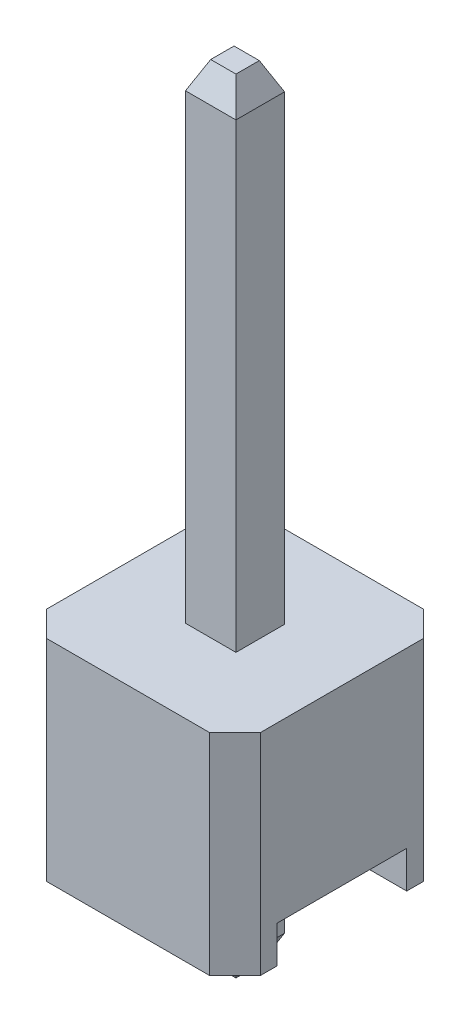
ISO-10303-21;
HEADER;
FILE_DESCRIPTION(('STEP AP214'),'2;1');
FILE_NAME('part.step','',(''),(''),'','','');
FILE_SCHEMA(('AUTOMOTIVE_DESIGN { 1 0 10303 214 1 1 1 1 }'));
ENDSEC;
DATA;
#1=APPLICATION_CONTEXT('core data for automotive mechanical design processes');
#2=APPLICATION_PROTOCOL_DEFINITION('international standard','automotive_design',2000,#1);
#3=PRODUCT_CONTEXT('',#1,'mechanical');
#4=PRODUCT('Part','Part','',(#3));
#5=PRODUCT_RELATED_PRODUCT_CATEGORY('part','',(#4));
#6=PRODUCT_DEFINITION_FORMATION('','',#4);
#7=PRODUCT_DEFINITION_CONTEXT('part definition',#1,'design');
#8=PRODUCT_DEFINITION('design','',#6,#7);
#9=PRODUCT_DEFINITION_SHAPE('','',#8);
#10=(LENGTH_UNIT() NAMED_UNIT(*) SI_UNIT(.MILLI.,.METRE.));
#11=(NAMED_UNIT(*) PLANE_ANGLE_UNIT() SI_UNIT($,.RADIAN.));
#12=(NAMED_UNIT(*) SI_UNIT($,.STERADIAN.) SOLID_ANGLE_UNIT());
#13=UNCERTAINTY_MEASURE_WITH_UNIT(LENGTH_MEASURE(1.E-05),#10,'distance_accuracy_value','');
#14=(GEOMETRIC_REPRESENTATION_CONTEXT(3) GLOBAL_UNCERTAINTY_ASSIGNED_CONTEXT((#13)) GLOBAL_UNIT_ASSIGNED_CONTEXT((#10,
#11,#12)) REPRESENTATION_CONTEXT('',''));
#15=CARTESIAN_POINT('',(0.,0.,0.));
#16=DIRECTION('',(0.,0.,1.));
#17=DIRECTION('',(1.,0.,0.));
#18=AXIS2_PLACEMENT_3D('',#15,#16,#17);
#19=CARTESIAN_POINT('',(15.6674969604626,-5.69124998633488,4.81287404611807));
#20=DIRECTION('',(0.,-1.,0.));
#21=DIRECTION('',(0.,0.,-1.));
#22=AXIS2_PLACEMENT_3D('',#19,#20,#21);
#23=PLANE('',#22);
#24=DIRECTION('',(1.,0.,0.));
#25=VECTOR('',#24,1.);
#26=CARTESIAN_POINT('',(15.0674969604626,-5.69124998633488,4.96287404611807));
#27=LINE('',#26,#25);
#28=CARTESIAN_POINT('',(15.2174969604626,-5.69124998633488,4.96287404611807));
#29=VERTEX_POINT('',#28);
#30=CARTESIAN_POINT('',(15.5174969604626,-5.69124998633488,4.96287404611807));
#31=VERTEX_POINT('',#30);
#32=EDGE_CURVE('E194',#29,#31,#27,.T.);
#33=ORIENTED_EDGE('',*,*,#32,.T.);
#34=DIRECTION('',(0.,0.,1.));
#35=VECTOR('',#34,1.);
#36=CARTESIAN_POINT('',(15.5174969604626,-5.69124998633488,4.81287404611807));
#37=LINE('',#36,#35);
#38=CARTESIAN_POINT('',(15.5174969604626,-5.69124998633488,5.24038017622598));
#39=VERTEX_POINT('',#38);
#40=EDGE_CURVE('E179',#31,#39,#37,.T.);
#41=ORIENTED_EDGE('',*,*,#40,.T.);
#42=DIRECTION('',(1.,0.,0.));
#43=VECTOR('',#42,1.);
#44=CARTESIAN_POINT('',(15.6674969604626,-5.69124998633488,5.24038017622598));
#45=LINE('',#44,#43);
#46=CARTESIAN_POINT('',(15.2174969604626,-5.69124998633488,5.24038017622598));
#47=VERTEX_POINT('',#46);
#48=EDGE_CURVE('E20',#39,#47,#45,.F.);
#49=ORIENTED_EDGE('',*,*,#48,.T.);
#50=DIRECTION('',(0.,0.,1.));
#51=VECTOR('',#50,1.);
#52=CARTESIAN_POINT('',(15.2174969604626,-5.69124998633488,5.39038017622598));
#53=LINE('',#52,#51);
#54=EDGE_CURVE('E174',#47,#29,#53,.F.);
#55=ORIENTED_EDGE('',*,*,#54,.T.);
#56=EDGE_LOOP('',(#33,#41,#49,#55));
#57=FACE_BOUND('',#56,.T.);
#58=ADVANCED_FACE('F17',(#57),#23,.T.);
#59=CARTESIAN_POINT('',(15.6674969604626,-5.36957394825845,5.39038017622598));
#60=DIRECTION('',(0.,0.4226182617407,-0.90630778703665));
#61=DIRECTION('',(0.,0.90630778703665,0.4226182617407));
#62=AXIS2_PLACEMENT_3D('',#59,#60,#61);
#63=PLANE('',#62);
#64=DIRECTION('',(1.,0.,0.));
#65=VECTOR('',#64,1.);
#66=CARTESIAN_POINT('',(15.6674969604626,-5.36957394825845,5.39038017622598));
#67=LINE('',#66,#65);
#68=CARTESIAN_POINT('',(15.0674969604626,-5.36957394825845,5.39038017622598));
#69=VERTEX_POINT('',#68);
#70=CARTESIAN_POINT('',(15.6674969604626,-5.36957394825845,5.39038017622598));
#71=VERTEX_POINT('',#70);
#72=EDGE_CURVE('E186',#69,#71,#67,.T.);
#73=ORIENTED_EDGE('',*,*,#72,.F.);
#74=DIRECTION('',(0.389281620635027,-0.834817129478987,-0.389281620635025));
#75=VECTOR('',#74,1.);
#76=CARTESIAN_POINT('',(15.0674969604626,-5.36957394825845,5.39038017622598));
#77=LINE('',#76,#75);
#78=EDGE_CURVE('E182',#69,#47,#77,.T.);
#79=ORIENTED_EDGE('',*,*,#78,.T.);
#80=ORIENTED_EDGE('',*,*,#48,.F.);
#81=DIRECTION('',(0.389281620635028,0.834817129478986,0.389281620635026));
#82=VECTOR('',#81,1.);
#83=CARTESIAN_POINT('',(15.5174969604626,-5.69124998633488,5.24038017622598));
#84=LINE('',#83,#82);
#85=EDGE_CURVE('E202',#39,#71,#84,.T.);
#86=ORIENTED_EDGE('',*,*,#85,.T.);
#87=EDGE_LOOP('',(#73,#79,#80,#86));
#88=FACE_BOUND('',#87,.T.);
#89=ADVANCED_FACE('F184',(#88),#63,.F.);
#90=CARTESIAN_POINT('',(15.0674969604626,-5.36957394825845,5.39038017622598));
#91=DIRECTION('',(0.906307787036649,0.422618261740701,0.));
#92=DIRECTION('',(-0.422618261740701,0.906307787036649,0.));
#93=AXIS2_PLACEMENT_3D('',#90,#91,#92);
#94=PLANE('',#93);
#95=ORIENTED_EDGE('',*,*,#54,.F.);
#96=ORIENTED_EDGE('',*,*,#78,.F.);
#97=DIRECTION('',(0.,0.,1.));
#98=VECTOR('',#97,1.);
#99=CARTESIAN_POINT('',(15.0674969604626,-5.36957394825845,5.39038017622598));
#100=LINE('',#99,#98);
#101=CARTESIAN_POINT('',(15.0674969604626,-5.36957394825845,4.81287404611807));
#102=VERTEX_POINT('',#101);
#103=EDGE_CURVE('E205',#102,#69,#100,.T.);
#104=ORIENTED_EDGE('',*,*,#103,.F.);
#105=DIRECTION('',(0.389281620635028,-0.834817129478986,0.389281620635026));
#106=VECTOR('',#105,1.);
#107=CARTESIAN_POINT('',(15.0674969604626,-5.36957394825845,4.81287404611807));
#108=LINE('',#107,#106);
#109=EDGE_CURVE('E191',#102,#29,#108,.T.);
#110=ORIENTED_EDGE('',*,*,#109,.T.);
#111=EDGE_LOOP('',(#95,#96,#104,#110));
#112=FACE_BOUND('',#111,.T.);
#113=ADVANCED_FACE('F189',(#112),#94,.F.);
#114=CARTESIAN_POINT('',(15.0674969604626,-5.36957394825845,4.81287404611807));
#115=DIRECTION('',(0.,0.422618261740701,0.906307787036649));
#116=DIRECTION('',(0.,-0.906307787036649,0.422618261740701));
#117=AXIS2_PLACEMENT_3D('',#114,#115,#116);
#118=PLANE('',#117);
#119=ORIENTED_EDGE('',*,*,#32,.F.);
#120=ORIENTED_EDGE('',*,*,#109,.F.);
#121=DIRECTION('',(-1.,0.,0.));
#122=VECTOR('',#121,1.);
#123=CARTESIAN_POINT('',(15.0674969604626,-5.36957394825845,4.81287404611807));
#124=LINE('',#123,#122);
#125=CARTESIAN_POINT('',(15.6674969604626,-5.36957394825845,4.81287404611807));
#126=VERTEX_POINT('',#125);
#127=EDGE_CURVE('E211',#126,#102,#124,.T.);
#128=ORIENTED_EDGE('',*,*,#127,.F.);
#129=DIRECTION('',(-0.389281620635029,-0.834817129478987,0.389281620635022));
#130=VECTOR('',#129,1.);
#131=CARTESIAN_POINT('',(15.6674969604626,-5.36957394825845,4.81287404611807));
#132=LINE('',#131,#130);
#133=EDGE_CURVE('E198',#126,#31,#132,.T.);
#134=ORIENTED_EDGE('',*,*,#133,.T.);
#135=EDGE_LOOP('',(#119,#120,#128,#134));
#136=FACE_BOUND('',#135,.T.);
#137=ADVANCED_FACE('F518',(#136),#118,.F.);
#138=CARTESIAN_POINT('',(15.6674969604626,-5.36957394825845,4.81287404611807));
#139=DIRECTION('',(-0.906307787036649,0.422618261740701,0.));
#140=DIRECTION('',(-0.422618261740701,-0.906307787036649,0.));
#141=AXIS2_PLACEMENT_3D('',#138,#139,#140);
#142=PLANE('',#141);
#143=ORIENTED_EDGE('',*,*,#40,.F.);
#144=ORIENTED_EDGE('',*,*,#133,.F.);
#145=DIRECTION('',(0.,0.,-1.));
#146=VECTOR('',#145,1.);
#147=CARTESIAN_POINT('',(15.6674969604626,-5.36957394825845,4.81287404611807));
#148=LINE('',#147,#146);
#149=EDGE_CURVE('E220',#71,#126,#148,.T.);
#150=ORIENTED_EDGE('',*,*,#149,.F.);
#151=ORIENTED_EDGE('',*,*,#85,.F.);
#152=EDGE_LOOP('',(#143,#144,#150,#151));
#153=FACE_BOUND('',#152,.T.);
#154=ADVANCED_FACE('F514',(#153),#142,.F.);
#155=CARTESIAN_POINT('',(15.6674969604626,-5.69124998633488,5.39038017622598));
#156=DIRECTION('',(0.,0.,1.));
#157=DIRECTION('',(1.,0.,0.));
#158=AXIS2_PLACEMENT_3D('',#155,#156,#157);
#159=PLANE('',#158);
#160=DIRECTION('',(0.,1.,0.));
#161=VECTOR('',#160,1.);
#162=CARTESIAN_POINT('',(15.6674969604626,-5.69124998633488,5.39038017622598));
#163=LINE('',#162,#161);
#164=CARTESIAN_POINT('',(15.6674969604626,-4.25124998633488,5.39038017622598));
#165=VERTEX_POINT('',#164);
#166=EDGE_CURVE('E217',#165,#71,#163,.F.);
#167=ORIENTED_EDGE('',*,*,#166,.F.);
#168=DIRECTION('',(1.,0.,0.));
#169=VECTOR('',#168,1.);
#170=CARTESIAN_POINT('',(14.0974969604626,-4.25124998633488,5.39038017622598));
#171=LINE('',#170,#169);
#172=CARTESIAN_POINT('',(15.0674969604626,-4.25124998633488,5.39038017622598));
#173=VERTEX_POINT('',#172);
#174=EDGE_CURVE('E230',#165,#173,#171,.F.);
#175=ORIENTED_EDGE('',*,*,#174,.T.);
#176=DIRECTION('',(0.,1.,0.));
#177=VECTOR('',#176,1.);
#178=CARTESIAN_POINT('',(15.0674969604626,-5.69124998633488,5.39038017622598));
#179=LINE('',#178,#177);
#180=EDGE_CURVE('E208',#69,#173,#179,.T.);
#181=ORIENTED_EDGE('',*,*,#180,.F.);
#182=ORIENTED_EDGE('',*,*,#72,.T.);
#183=EDGE_LOOP('',(#167,#175,#181,#182));
#184=FACE_BOUND('',#183,.T.);
#185=ADVANCED_FACE('F510',(#184),#159,.T.);
#186=CARTESIAN_POINT('',(15.0674969604626,-5.69124998633488,5.39038017622598));
#187=DIRECTION('',(-1.,0.,0.));
#188=DIRECTION('',(0.,0.,1.));
#189=AXIS2_PLACEMENT_3D('',#186,#187,#188);
#190=PLANE('',#189);
#191=ORIENTED_EDGE('',*,*,#180,.T.);
#192=DIRECTION('',(0.,0.,1.));
#193=VECTOR('',#192,1.);
#194=CARTESIAN_POINT('',(15.0674969604626,-4.25124998633488,5.87162711117202));
#195=LINE('',#194,#193);
#196=CARTESIAN_POINT('',(15.0674969604626,-4.25124998633488,4.81287404611807));
#197=VERTEX_POINT('',#196);
#198=EDGE_CURVE('E232',#173,#197,#195,.F.);
#199=ORIENTED_EDGE('',*,*,#198,.T.);
#200=DIRECTION('',(0.,1.,0.));
#201=VECTOR('',#200,1.);
#202=CARTESIAN_POINT('',(15.0674969604626,-5.69124998633488,4.81287404611807));
#203=LINE('',#202,#201);
#204=EDGE_CURVE('E214',#102,#197,#203,.T.);
#205=ORIENTED_EDGE('',*,*,#204,.F.);
#206=ORIENTED_EDGE('',*,*,#103,.T.);
#207=EDGE_LOOP('',(#191,#199,#205,#206));
#208=FACE_BOUND('',#207,.T.);
#209=ADVANCED_FACE('F506',(#208),#190,.T.);
#210=CARTESIAN_POINT('',(15.0674969604626,-5.69124998633488,4.81287404611807));
#211=DIRECTION('',(0.,0.,-1.));
#212=DIRECTION('',(-1.,0.,0.));
#213=AXIS2_PLACEMENT_3D('',#210,#211,#212);
#214=PLANE('',#213);
#215=ORIENTED_EDGE('',*,*,#204,.T.);
#216=DIRECTION('',(1.,0.,0.));
#217=VECTOR('',#216,1.);
#218=CARTESIAN_POINT('',(14.0974969604626,-4.25124998633488,4.81287404611807));
#219=LINE('',#218,#217);
#220=CARTESIAN_POINT('',(15.6674969604626,-4.25124998633488,4.81287404611807));
#221=VERTEX_POINT('',#220);
#222=EDGE_CURVE('E234',#197,#221,#219,.T.);
#223=ORIENTED_EDGE('',*,*,#222,.T.);
#224=DIRECTION('',(0.,1.,0.));
#225=VECTOR('',#224,1.);
#226=CARTESIAN_POINT('',(15.6674969604626,-5.69124998633488,4.81287404611807));
#227=LINE('',#226,#225);
#228=EDGE_CURVE('E223',#126,#221,#227,.T.);
#229=ORIENTED_EDGE('',*,*,#228,.F.);
#230=ORIENTED_EDGE('',*,*,#127,.T.);
#231=EDGE_LOOP('',(#215,#223,#229,#230));
#232=FACE_BOUND('',#231,.T.);
#233=ADVANCED_FACE('F502',(#232),#214,.T.);
#234=CARTESIAN_POINT('',(15.6674969604626,-5.69124998633488,4.81287404611807));
#235=DIRECTION('',(1.,0.,0.));
#236=DIRECTION('',(0.,0.,-1.));
#237=AXIS2_PLACEMENT_3D('',#234,#235,#236);
#238=PLANE('',#237);
#239=ORIENTED_EDGE('',*,*,#228,.T.);
#240=DIRECTION('',(0.,0.,1.));
#241=VECTOR('',#240,1.);
#242=CARTESIAN_POINT('',(15.6674969604626,-4.25124998633488,5.87162711117202));
#243=LINE('',#242,#241);
#244=EDGE_CURVE('E236',#221,#165,#243,.T.);
#245=ORIENTED_EDGE('',*,*,#244,.T.);
#246=ORIENTED_EDGE('',*,*,#166,.T.);
#247=ORIENTED_EDGE('',*,*,#149,.T.);
#248=EDGE_LOOP('',(#239,#245,#246,#247));
#249=FACE_BOUND('',#248,.T.);
#250=ADVANCED_FACE('F498',(#249),#238,.T.);
#251=CARTESIAN_POINT('',(14.0974969604626,-4.25124998633488,5.87162711117202));
#252=DIRECTION('',(0.,1.,0.));
#253=DIRECTION('',(0.,0.,1.));
#254=AXIS2_PLACEMENT_3D('',#251,#252,#253);
#255=PLANE('',#254);
#256=ORIENTED_EDGE('',*,*,#222,.F.);
#257=ORIENTED_EDGE('',*,*,#198,.F.);
#258=ORIENTED_EDGE('',*,*,#174,.F.);
#259=ORIENTED_EDGE('',*,*,#244,.F.);
#260=EDGE_LOOP('',(#256,#257,#258,#259));
#261=FACE_BOUND('',#260,.T.);
#262=DIRECTION('',(-1.,0.,0.));
#263=VECTOR('',#262,1.);
#264=CARTESIAN_POINT('',(14.0974969604626,-4.25124998633488,4.33162711117202));
#265=LINE('',#264,#263);
#266=CARTESIAN_POINT('',(14.0974969604626,-4.25124998633488,4.33162711117202));
#267=VERTEX_POINT('',#266);
#268=CARTESIAN_POINT('',(16.6374969604626,-4.25124998633488,4.33162711117202));
#269=VERTEX_POINT('',#268);
#270=EDGE_CURVE('E241',#267,#269,#265,.F.);
#271=ORIENTED_EDGE('',*,*,#270,.T.);
#272=DIRECTION('',(0.,0.,1.));
#273=VECTOR('',#272,1.);
#274=CARTESIAN_POINT('',(16.6374969604626,-4.25124998633488,5.87162711117202));
#275=LINE('',#274,#273);
#276=CARTESIAN_POINT('',(16.6374969604626,-4.25124998633488,5.87162711117202));
#277=VERTEX_POINT('',#276);
#278=EDGE_CURVE('E226',#277,#269,#275,.F.);
#279=ORIENTED_EDGE('',*,*,#278,.F.);
#280=DIRECTION('',(1.,0.,0.));
#281=VECTOR('',#280,1.);
#282=CARTESIAN_POINT('',(14.0974969604626,-4.25124998633488,5.87162711117202));
#283=LINE('',#282,#281);
#284=CARTESIAN_POINT('',(14.0974969604626,-4.25124998633488,5.87162711117202));
#285=VERTEX_POINT('',#284);
#286=EDGE_CURVE('E248',#277,#285,#283,.F.);
#287=ORIENTED_EDGE('',*,*,#286,.T.);
#288=DIRECTION('',(0.,0.,1.));
#289=VECTOR('',#288,1.);
#290=CARTESIAN_POINT('',(14.0974969604626,-4.25124998633488,5.87162711117202));
#291=LINE('',#290,#289);
#292=EDGE_CURVE('E228',#267,#285,#291,.T.);
#293=ORIENTED_EDGE('',*,*,#292,.F.);
#294=EDGE_LOOP('',(#271,#279,#287,#293));
#295=FACE_BOUND('',#294,.T.);
#296=ADVANCED_FACE('F495',(#261,#295),#255,.F.);
#297=CARTESIAN_POINT('',(15.5174969604626,3.60875001366512,4.81287404611807));
#298=DIRECTION('',(0.906307787036651,0.422618261740697,0.));
#299=DIRECTION('',(-0.422618261740697,0.906307787036651,0.));
#300=AXIS2_PLACEMENT_3D('',#297,#298,#299);
#301=PLANE('',#300);
#302=DIRECTION('',(0.389281620635022,-0.83481712947899,-0.389281620635024));
#303=VECTOR('',#302,1.);
#304=CARTESIAN_POINT('',(15.5174969604626,3.60875001366512,4.96287404611807));
#305=LINE('',#304,#303);
#306=CARTESIAN_POINT('',(15.5174969604626,3.60875001366512,4.96287404611807));
#307=VERTEX_POINT('',#306);
#308=CARTESIAN_POINT('',(15.6674969604626,3.28707397558869,4.81287404611807));
#309=VERTEX_POINT('',#308);
#310=EDGE_CURVE('E263',#307,#309,#305,.T.);
#311=ORIENTED_EDGE('',*,*,#310,.F.);
#312=DIRECTION('',(0.,0.,-1.));
#313=VECTOR('',#312,1.);
#314=CARTESIAN_POINT('',(15.5174969604626,3.60875001366512,4.81287404611807));
#315=LINE('',#314,#313);
#316=CARTESIAN_POINT('',(15.5174969604626,3.60875001366512,5.24038017622598));
#317=VERTEX_POINT('',#316);
#318=EDGE_CURVE('E256',#307,#317,#315,.F.);
#319=ORIENTED_EDGE('',*,*,#318,.T.);
#320=DIRECTION('',(-0.389281620635021,0.834817129478991,-0.389281620635023));
#321=VECTOR('',#320,1.);
#322=CARTESIAN_POINT('',(15.6674969604626,3.28707397558869,5.39038017622598));
#323=LINE('',#322,#321);
#324=CARTESIAN_POINT('',(15.6674969604626,3.28707397558869,5.39038017622598));
#325=VERTEX_POINT('',#324);
#326=EDGE_CURVE('E253',#325,#317,#323,.T.);
#327=ORIENTED_EDGE('',*,*,#326,.F.);
#328=DIRECTION('',(0.,0.,-1.));
#329=VECTOR('',#328,1.);
#330=CARTESIAN_POINT('',(15.6674969604626,3.28707397558869,4.81287404611807));
#331=LINE('',#330,#329);
#332=EDGE_CURVE('E266',#309,#325,#331,.F.);
#333=ORIENTED_EDGE('',*,*,#332,.F.);
#334=EDGE_LOOP('',(#311,#319,#327,#333));
#335=FACE_BOUND('',#334,.T.);
#336=ADVANCED_FACE('F472',(#335),#301,.T.);
#337=CARTESIAN_POINT('',(14.0974969604626,-4.25124998633488,4.33162711117202));
#338=DIRECTION('',(0.,0.,-1.));
#339=DIRECTION('',(-1.,0.,0.));
#340=AXIS2_PLACEMENT_3D('',#337,#338,#339);
#341=PLANE('',#340);
#342=DIRECTION('',(0.,1.,0.));
#343=VECTOR('',#342,1.);
#344=CARTESIAN_POINT('',(16.6374969604626,-4.25124998633488,4.33162711117202));
#345=LINE('',#344,#343);
#346=CARTESIAN_POINT('',(16.6374969604626,-4.69124998633488,4.33162711117202));
#347=VERTEX_POINT('',#346);
#348=EDGE_CURVE('E244',#269,#347,#345,.F.);
#349=ORIENTED_EDGE('',*,*,#348,.F.);
#350=ORIENTED_EDGE('',*,*,#270,.F.);
#351=DIRECTION('',(0.,1.,0.));
#352=VECTOR('',#351,1.);
#353=CARTESIAN_POINT('',(14.0974969604626,-4.25124998633488,4.33162711117202));
#354=LINE('',#353,#352);
#355=CARTESIAN_POINT('',(14.0974969604626,-4.69124998633488,4.33162711117202));
#356=VERTEX_POINT('',#355);
#357=EDGE_CURVE('E239',#356,#267,#354,.T.);
#358=ORIENTED_EDGE('',*,*,#357,.F.);
#359=DIRECTION('',(1.,0.,0.));
#360=VECTOR('',#359,1.);
#361=CARTESIAN_POINT('',(15.3674969604626,-4.69124998633488,4.33162711117202));
#362=LINE('',#361,#360);
#363=EDGE_CURVE('E273',#356,#347,#362,.T.);
#364=ORIENTED_EDGE('',*,*,#363,.T.);
#365=EDGE_LOOP('',(#349,#350,#358,#364));
#366=FACE_BOUND('',#365,.T.);
#367=ADVANCED_FACE('F488',(#366),#341,.F.);
#368=CARTESIAN_POINT('',(14.0974969604626,-4.25124998633488,5.87162711117202));
#369=DIRECTION('',(0.,0.,1.));
#370=DIRECTION('',(1.,0.,0.));
#371=AXIS2_PLACEMENT_3D('',#368,#369,#370);
#372=PLANE('',#371);
#373=DIRECTION('',(0.,1.,0.));
#374=VECTOR('',#373,1.);
#375=CARTESIAN_POINT('',(14.0974969604626,-4.25124998633488,5.87162711117202));
#376=LINE('',#375,#374);
#377=CARTESIAN_POINT('',(14.0974969604626,-4.69124998633488,5.87162711117202));
#378=VERTEX_POINT('',#377);
#379=EDGE_CURVE('E251',#285,#378,#376,.F.);
#380=ORIENTED_EDGE('',*,*,#379,.F.);
#381=ORIENTED_EDGE('',*,*,#286,.F.);
#382=DIRECTION('',(0.,1.,0.));
#383=VECTOR('',#382,1.);
#384=CARTESIAN_POINT('',(16.6374969604626,-4.25124998633488,5.87162711117202));
#385=LINE('',#384,#383);
#386=CARTESIAN_POINT('',(16.6374969604626,-4.69124998633488,5.87162711117202));
#387=VERTEX_POINT('',#386);
#388=EDGE_CURVE('E246',#387,#277,#385,.T.);
#389=ORIENTED_EDGE('',*,*,#388,.F.);
#390=DIRECTION('',(1.,0.,0.));
#391=VECTOR('',#390,1.);
#392=CARTESIAN_POINT('',(15.3674969604626,-4.69124998633488,5.87162711117202));
#393=LINE('',#392,#391);
#394=EDGE_CURVE('E288',#387,#378,#393,.F.);
#395=ORIENTED_EDGE('',*,*,#394,.T.);
#396=EDGE_LOOP('',(#380,#381,#389,#395));
#397=FACE_BOUND('',#396,.T.);
#398=ADVANCED_FACE('F482',(#397),#372,.F.);
#399=CARTESIAN_POINT('',(15.6674969604626,3.60875001366512,5.24038017622598));
#400=DIRECTION('',(0.,0.422618261740697,0.906307787036651));
#401=DIRECTION('',(0.,-0.906307787036651,0.422618261740697));
#402=AXIS2_PLACEMENT_3D('',#399,#400,#401);
#403=PLANE('',#402);
#404=ORIENTED_EDGE('',*,*,#326,.T.);
#405=DIRECTION('',(1.,0.,0.));
#406=VECTOR('',#405,1.);
#407=CARTESIAN_POINT('',(15.6674969604626,3.60875001366512,5.24038017622598));
#408=LINE('',#407,#406);
#409=CARTESIAN_POINT('',(15.2174969604626,3.60875001366512,5.24038017622598));
#410=VERTEX_POINT('',#409);
#411=EDGE_CURVE('E258',#317,#410,#408,.F.);
#412=ORIENTED_EDGE('',*,*,#411,.T.);
#413=DIRECTION('',(0.389281620635024,0.83481712947899,-0.389281620635022));
#414=VECTOR('',#413,1.);
#415=CARTESIAN_POINT('',(15.0674969604626,3.28707397558869,5.39038017622598));
#416=LINE('',#415,#414);
#417=CARTESIAN_POINT('',(15.0674969604626,3.28707397558869,5.39038017622598));
#418=VERTEX_POINT('',#417);
#419=EDGE_CURVE('E310',#418,#410,#416,.T.);
#420=ORIENTED_EDGE('',*,*,#419,.F.);
#421=DIRECTION('',(1.,0.,0.));
#422=VECTOR('',#421,1.);
#423=CARTESIAN_POINT('',(15.6674969604626,3.28707397558869,5.39038017622598));
#424=LINE('',#423,#422);
#425=EDGE_CURVE('E303',#325,#418,#424,.F.);
#426=ORIENTED_EDGE('',*,*,#425,.F.);
#427=EDGE_LOOP('',(#404,#412,#420,#426));
#428=FACE_BOUND('',#427,.T.);
#429=ADVANCED_FACE('F466',(#428),#403,.T.);
#430=CARTESIAN_POINT('',(15.6674969604626,3.60875001366512,4.81287404611807));
#431=DIRECTION('',(0.,-1.,0.));
#432=DIRECTION('',(0.,0.,-1.));
#433=AXIS2_PLACEMENT_3D('',#430,#431,#432);
#434=PLANE('',#433);
#435=ORIENTED_EDGE('',*,*,#318,.F.);
#436=DIRECTION('',(1.,0.,0.));
#437=VECTOR('',#436,1.);
#438=CARTESIAN_POINT('',(15.6674969604626,3.60875001366512,4.96287404611807));
#439=LINE('',#438,#437);
#440=CARTESIAN_POINT('',(15.2174969604626,3.60875001366512,4.96287404611807));
#441=VERTEX_POINT('',#440);
#442=EDGE_CURVE('E260',#441,#307,#439,.T.);
#443=ORIENTED_EDGE('',*,*,#442,.F.);
#444=DIRECTION('',(0.,0.,1.));
#445=VECTOR('',#444,1.);
#446=CARTESIAN_POINT('',(15.2174969604626,3.60875001366512,4.81287404611807));
#447=LINE('',#446,#445);
#448=EDGE_CURVE('E313',#410,#441,#447,.F.);
#449=ORIENTED_EDGE('',*,*,#448,.F.);
#450=ORIENTED_EDGE('',*,*,#411,.F.);
#451=EDGE_LOOP('',(#435,#443,#449,#450));
#452=FACE_BOUND('',#451,.T.);
#453=ADVANCED_FACE('F474',(#452),#434,.F.);
#454=CARTESIAN_POINT('',(15.6674969604626,3.60875001366512,4.96287404611807));
#455=DIRECTION('',(0.,0.422618261740697,-0.906307787036651));
#456=DIRECTION('',(0.,0.906307787036651,0.422618261740697));
#457=AXIS2_PLACEMENT_3D('',#454,#455,#456);
#458=PLANE('',#457);
#459=ORIENTED_EDGE('',*,*,#310,.T.);
#460=DIRECTION('',(-1.,0.,0.));
#461=VECTOR('',#460,1.);
#462=CARTESIAN_POINT('',(15.0674969604626,3.28707397558869,4.81287404611807));
#463=LINE('',#462,#461);
#464=CARTESIAN_POINT('',(15.0674969604626,3.28707397558869,4.81287404611807));
#465=VERTEX_POINT('',#464);
#466=EDGE_CURVE('E316',#465,#309,#463,.F.);
#467=ORIENTED_EDGE('',*,*,#466,.F.);
#468=DIRECTION('',(-0.389281620635025,-0.834817129478991,-0.389281620635018));
#469=VECTOR('',#468,1.);
#470=CARTESIAN_POINT('',(15.2174969604626,3.60875001366512,4.96287404611807));
#471=LINE('',#470,#469);
#472=EDGE_CURVE('E307',#441,#465,#471,.T.);
#473=ORIENTED_EDGE('',*,*,#472,.F.);
#474=ORIENTED_EDGE('',*,*,#442,.T.);
#475=EDGE_LOOP('',(#459,#467,#473,#474));
#476=FACE_BOUND('',#475,.T.);
#477=ADVANCED_FACE('F471',(#476),#458,.T.);
#478=CARTESIAN_POINT('',(15.6674969604626,-5.69124998633488,4.81287404611807));
#479=DIRECTION('',(1.,0.,0.));
#480=DIRECTION('',(0.,0.,-1.));
#481=AXIS2_PLACEMENT_3D('',#478,#479,#480);
#482=PLANE('',#481);
#483=DIRECTION('',(0.,1.,0.));
#484=VECTOR('',#483,1.);
#485=CARTESIAN_POINT('',(15.6674969604626,-5.69124998633488,5.39038017622598));
#486=LINE('',#485,#484);
#487=CARTESIAN_POINT('',(15.6674969604626,-2.19124998633488,5.39038017622598));
#488=VERTEX_POINT('',#487);
#489=EDGE_CURVE('E300',#488,#325,#486,.T.);
#490=ORIENTED_EDGE('',*,*,#489,.F.);
#491=DIRECTION('',(0.,0.,-1.));
#492=VECTOR('',#491,1.);
#493=CARTESIAN_POINT('',(15.6674969604626,-2.19124998633488,4.81287404611807));
#494=LINE('',#493,#492);
#495=CARTESIAN_POINT('',(15.6674969604626,-2.19124998633488,4.81287404611807));
#496=VERTEX_POINT('',#495);
#497=EDGE_CURVE('E269',#488,#496,#494,.T.);
#498=ORIENTED_EDGE('',*,*,#497,.T.);
#499=DIRECTION('',(0.,1.,0.));
#500=VECTOR('',#499,1.);
#501=CARTESIAN_POINT('',(15.6674969604626,-5.69124998633488,4.81287404611807));
#502=LINE('',#501,#500);
#503=EDGE_CURVE('E319',#309,#496,#502,.F.);
#504=ORIENTED_EDGE('',*,*,#503,.F.);
#505=ORIENTED_EDGE('',*,*,#332,.T.);
#506=EDGE_LOOP('',(#490,#498,#504,#505));
#507=FACE_BOUND('',#506,.T.);
#508=ADVANCED_FACE('F462',(#507),#482,.T.);
#509=CARTESIAN_POINT('',(15.3674969604626,-4.69124998633488,2.86162711117202));
#510=DIRECTION('',(0.,1.,0.));
#511=DIRECTION('',(0.,0.,1.));
#512=AXIS2_PLACEMENT_3D('',#509,#510,#511);
#513=PLANE('',#512);
#514=ORIENTED_EDGE('',*,*,#363,.F.);
#515=DIRECTION('',(0.,0.,1.));
#516=VECTOR('',#515,1.);
#517=CARTESIAN_POINT('',(14.0974969604626,-4.69124998633488,2.86162711117202));
#518=LINE('',#517,#516);
#519=CARTESIAN_POINT('',(14.0974969604626,-4.69124998633488,4.13162711117202));
#520=VERTEX_POINT('',#519);
#521=EDGE_CURVE('E271',#520,#356,#518,.T.);
#522=ORIENTED_EDGE('',*,*,#521,.F.);
#523=DIRECTION('',(0.707106781186547,0.,-0.707106781186548));
#524=VECTOR('',#523,1.);
#525=CARTESIAN_POINT('',(14.3974969604626,-4.69124998633488,3.83162711117202));
#526=LINE('',#525,#524);
#527=CARTESIAN_POINT('',(14.3974969604626,-4.69124998633488,3.83162711117202));
#528=VERTEX_POINT('',#527);
#529=EDGE_CURVE('E280',#520,#528,#526,.T.);
#530=ORIENTED_EDGE('',*,*,#529,.T.);
#531=DIRECTION('',(1.,0.,0.));
#532=VECTOR('',#531,1.);
#533=CARTESIAN_POINT('',(16.3374969604626,-4.69124998633488,3.83162711117202));
#534=LINE('',#533,#532);
#535=CARTESIAN_POINT('',(16.3374969604626,-4.69124998633488,3.83162711117202));
#536=VERTEX_POINT('',#535);
#537=EDGE_CURVE('E330',#528,#536,#534,.T.);
#538=ORIENTED_EDGE('',*,*,#537,.T.);
#539=DIRECTION('',(0.707106781186546,0.,0.707106781186549));
#540=VECTOR('',#539,1.);
#541=CARTESIAN_POINT('',(16.6374969604626,-4.69124998633488,4.13162711117202));
#542=LINE('',#541,#540);
#543=CARTESIAN_POINT('',(16.6374969604626,-4.69124998633488,4.13162711117202));
#544=VERTEX_POINT('',#543);
#545=EDGE_CURVE('E297',#536,#544,#542,.T.);
#546=ORIENTED_EDGE('',*,*,#545,.T.);
#547=DIRECTION('',(0.,0.,1.));
#548=VECTOR('',#547,1.);
#549=CARTESIAN_POINT('',(16.6374969604626,-4.69124998633488,2.86162711117202));
#550=LINE('',#549,#548);
#551=EDGE_CURVE('E276',#347,#544,#550,.F.);
#552=ORIENTED_EDGE('',*,*,#551,.F.);
#553=EDGE_LOOP('',(#514,#522,#530,#538,#546,#552));
#554=FACE_BOUND('',#553,.T.);
#555=ADVANCED_FACE('F655',(#554),#513,.F.);
#556=CARTESIAN_POINT('',(14.3974969604626,-2.19124998633488,3.83162711117202));
#557=DIRECTION('',(0.707106781186548,0.,0.707106781186547));
#558=DIRECTION('',(0.707106781186547,0.,-0.707106781186548));
#559=AXIS2_PLACEMENT_3D('',#556,#557,#558);
#560=PLANE('',#559);
#561=DIRECTION('',(0.,1.,0.));
#562=VECTOR('',#561,1.);
#563=CARTESIAN_POINT('',(14.0974969604626,-2.19124998633488,4.13162711117202));
#564=LINE('',#563,#562);
#565=CARTESIAN_POINT('',(14.0974969604626,-2.19124998633488,4.13162711117202));
#566=VERTEX_POINT('',#565);
#567=EDGE_CURVE('E333',#520,#566,#564,.T.);
#568=ORIENTED_EDGE('',*,*,#567,.T.);
#569=DIRECTION('',(0.707106781186547,0.,-0.707106781186548));
#570=VECTOR('',#569,1.);
#571=CARTESIAN_POINT('',(14.3974969604626,-2.19124998633488,3.83162711117202));
#572=LINE('',#571,#570);
#573=CARTESIAN_POINT('',(14.3974969604626,-2.19124998633488,3.83162711117202));
#574=VERTEX_POINT('',#573);
#575=EDGE_CURVE('E278',#574,#566,#572,.F.);
#576=ORIENTED_EDGE('',*,*,#575,.F.);
#577=DIRECTION('',(0.,1.,0.));
#578=VECTOR('',#577,1.);
#579=CARTESIAN_POINT('',(14.3974969604626,-2.19124998633488,3.83162711117202));
#580=LINE('',#579,#578);
#581=EDGE_CURVE('E327',#574,#528,#580,.F.);
#582=ORIENTED_EDGE('',*,*,#581,.T.);
#583=ORIENTED_EDGE('',*,*,#529,.F.);
#584=EDGE_LOOP('',(#568,#576,#582,#583));
#585=FACE_BOUND('',#584,.T.);
#586=ADVANCED_FACE('F395',(#585),#560,.F.);
#587=CARTESIAN_POINT('',(14.0974969604626,-2.19124998633488,6.07162711117202));
#588=DIRECTION('',(0.707106781186547,0.,-0.707106781186548));
#589=DIRECTION('',(-0.707106781186548,0.,-0.707106781186547));
#590=AXIS2_PLACEMENT_3D('',#587,#588,#589);
#591=PLANE('',#590);
#592=DIRECTION('',(0.,1.,0.));
#593=VECTOR('',#592,1.);
#594=CARTESIAN_POINT('',(14.3974969604626,-2.19124998633488,6.37162711117202));
#595=LINE('',#594,#593);
#596=CARTESIAN_POINT('',(14.3974969604626,-4.69124998633488,6.37162711117202));
#597=VERTEX_POINT('',#596);
#598=CARTESIAN_POINT('',(14.3974969604626,-2.19124998633488,6.37162711117202));
#599=VERTEX_POINT('',#598);
#600=EDGE_CURVE('E341',#597,#599,#595,.T.);
#601=ORIENTED_EDGE('',*,*,#600,.T.);
#602=DIRECTION('',(-0.707106781186548,0.,-0.707106781186547));
#603=VECTOR('',#602,1.);
#604=CARTESIAN_POINT('',(14.0974969604626,-2.19124998633488,6.07162711117202));
#605=LINE('',#604,#603);
#606=CARTESIAN_POINT('',(14.0974969604626,-2.19124998633488,6.07162711117202));
#607=VERTEX_POINT('',#606);
#608=EDGE_CURVE('E282',#607,#599,#605,.F.);
#609=ORIENTED_EDGE('',*,*,#608,.F.);
#610=DIRECTION('',(0.,1.,0.));
#611=VECTOR('',#610,1.);
#612=CARTESIAN_POINT('',(14.0974969604626,-2.19124998633488,6.07162711117202));
#613=LINE('',#612,#611);
#614=CARTESIAN_POINT('',(14.0974969604626,-4.69124998633488,6.07162711117202));
#615=VERTEX_POINT('',#614);
#616=EDGE_CURVE('E336',#607,#615,#613,.F.);
#617=ORIENTED_EDGE('',*,*,#616,.T.);
#618=DIRECTION('',(0.707106781186551,0.,0.707106781186544));
#619=VECTOR('',#618,1.);
#620=CARTESIAN_POINT('',(14.0974969604626,-4.69124998633488,6.07162711117202));
#621=LINE('',#620,#619);
#622=EDGE_CURVE('E284',#615,#597,#621,.T.);
#623=ORIENTED_EDGE('',*,*,#622,.T.);
#624=EDGE_LOOP('',(#601,#609,#617,#623));
#625=FACE_BOUND('',#624,.T.);
#626=ADVANCED_FACE('F402',(#625),#591,.F.);
#627=CARTESIAN_POINT('',(15.3674969604626,-4.69124998633488,2.86162711117202));
#628=DIRECTION('',(0.,1.,0.));
#629=DIRECTION('',(0.,0.,1.));
#630=AXIS2_PLACEMENT_3D('',#627,#628,#629);
#631=PLANE('',#630);
#632=ORIENTED_EDGE('',*,*,#394,.F.);
#633=DIRECTION('',(0.,0.,1.));
#634=VECTOR('',#633,1.);
#635=CARTESIAN_POINT('',(16.6374969604626,-4.69124998633488,2.86162711117202));
#636=LINE('',#635,#634);
#637=CARTESIAN_POINT('',(16.6374969604626,-4.69124998633488,6.07162711117202));
#638=VERTEX_POINT('',#637);
#639=EDGE_CURVE('E286',#638,#387,#636,.F.);
#640=ORIENTED_EDGE('',*,*,#639,.F.);
#641=DIRECTION('',(-0.707106781186549,0.,0.707106781186546));
#642=VECTOR('',#641,1.);
#643=CARTESIAN_POINT('',(16.3374969604626,-4.69124998633488,6.37162711117202));
#644=LINE('',#643,#642);
#645=CARTESIAN_POINT('',(16.3374969604626,-4.69124998633488,6.37162711117202));
#646=VERTEX_POINT('',#645);
#647=EDGE_CURVE('E293',#638,#646,#644,.T.);
#648=ORIENTED_EDGE('',*,*,#647,.T.);
#649=DIRECTION('',(-1.,0.,0.));
#650=VECTOR('',#649,1.);
#651=CARTESIAN_POINT('',(14.3974969604626,-4.69124998633488,6.37162711117202));
#652=LINE('',#651,#650);
#653=EDGE_CURVE('E347',#646,#597,#652,.T.);
#654=ORIENTED_EDGE('',*,*,#653,.T.);
#655=ORIENTED_EDGE('',*,*,#622,.F.);
#656=DIRECTION('',(0.,0.,-1.));
#657=VECTOR('',#656,1.);
#658=CARTESIAN_POINT('',(14.0974969604626,-4.69124998633488,4.13162711117202));
#659=LINE('',#658,#657);
#660=EDGE_CURVE('E338',#615,#378,#659,.T.);
#661=ORIENTED_EDGE('',*,*,#660,.T.);
#662=EDGE_LOOP('',(#632,#640,#648,#654,#655,#661));
#663=FACE_BOUND('',#662,.T.);
#664=ADVANCED_FACE('F405',(#663),#631,.F.);
#665=CARTESIAN_POINT('',(16.3374969604626,-2.19124998633488,6.37162711117202));
#666=DIRECTION('',(-0.707106781186546,0.,-0.707106781186549));
#667=DIRECTION('',(-0.707106781186549,0.,0.707106781186546));
#668=AXIS2_PLACEMENT_3D('',#665,#666,#667);
#669=PLANE('',#668);
#670=DIRECTION('',(0.,1.,0.));
#671=VECTOR('',#670,1.);
#672=CARTESIAN_POINT('',(16.6374969604626,-2.19124998633488,6.07162711117202));
#673=LINE('',#672,#671);
#674=CARTESIAN_POINT('',(16.6374969604626,-2.19124998633488,6.07162711117202));
#675=VERTEX_POINT('',#674);
#676=EDGE_CURVE('E350',#638,#675,#673,.T.);
#677=ORIENTED_EDGE('',*,*,#676,.T.);
#678=DIRECTION('',(-0.707106781186549,0.,0.707106781186546));
#679=VECTOR('',#678,1.);
#680=CARTESIAN_POINT('',(16.3374969604626,-2.19124998633488,6.37162711117202));
#681=LINE('',#680,#679);
#682=CARTESIAN_POINT('',(16.3374969604626,-2.19124998633488,6.37162711117202));
#683=VERTEX_POINT('',#682);
#684=EDGE_CURVE('E291',#683,#675,#681,.F.);
#685=ORIENTED_EDGE('',*,*,#684,.F.);
#686=DIRECTION('',(0.,1.,0.));
#687=VECTOR('',#686,1.);
#688=CARTESIAN_POINT('',(16.3374969604626,-2.19124998633488,6.37162711117202));
#689=LINE('',#688,#687);
#690=EDGE_CURVE('E344',#683,#646,#689,.F.);
#691=ORIENTED_EDGE('',*,*,#690,.T.);
#692=ORIENTED_EDGE('',*,*,#647,.F.);
#693=EDGE_LOOP('',(#677,#685,#691,#692));
#694=FACE_BOUND('',#693,.T.);
#695=ADVANCED_FACE('F414',(#694),#669,.F.);
#696=CARTESIAN_POINT('',(16.6374969604626,-2.19124998633488,4.13162711117202));
#697=DIRECTION('',(-0.707106781186549,0.,0.707106781186546));
#698=DIRECTION('',(0.707106781186546,0.,0.707106781186549));
#699=AXIS2_PLACEMENT_3D('',#696,#697,#698);
#700=PLANE('',#699);
#701=DIRECTION('',(0.,1.,0.));
#702=VECTOR('',#701,1.);
#703=CARTESIAN_POINT('',(16.3374969604626,-2.19124998633488,3.83162711117202));
#704=LINE('',#703,#702);
#705=CARTESIAN_POINT('',(16.3374969604626,-2.19124998633488,3.83162711117202));
#706=VERTEX_POINT('',#705);
#707=EDGE_CURVE('E324',#536,#706,#704,.T.);
#708=ORIENTED_EDGE('',*,*,#707,.T.);
#709=DIRECTION('',(0.707106781186546,0.,0.707106781186549));
#710=VECTOR('',#709,1.);
#711=CARTESIAN_POINT('',(16.6374969604626,-2.19124998633488,4.13162711117202));
#712=LINE('',#711,#710);
#713=CARTESIAN_POINT('',(16.6374969604626,-2.19124998633488,4.13162711117202));
#714=VERTEX_POINT('',#713);
#715=EDGE_CURVE('E295',#714,#706,#712,.F.);
#716=ORIENTED_EDGE('',*,*,#715,.F.);
#717=DIRECTION('',(0.,1.,0.));
#718=VECTOR('',#717,1.);
#719=CARTESIAN_POINT('',(16.6374969604626,-2.19124998633488,4.13162711117202));
#720=LINE('',#719,#718);
#721=EDGE_CURVE('E353',#714,#544,#720,.F.);
#722=ORIENTED_EDGE('',*,*,#721,.T.);
#723=ORIENTED_EDGE('',*,*,#545,.F.);
#724=EDGE_LOOP('',(#708,#716,#722,#723));
#725=FACE_BOUND('',#724,.T.);
#726=ADVANCED_FACE('F384',(#725),#700,.F.);
#727=CARTESIAN_POINT('',(15.6674969604626,-5.69124998633488,5.39038017622598));
#728=DIRECTION('',(0.,0.,1.));
#729=DIRECTION('',(1.,0.,0.));
#730=AXIS2_PLACEMENT_3D('',#727,#728,#729);
#731=PLANE('',#730);
#732=DIRECTION('',(0.,1.,0.));
#733=VECTOR('',#732,1.);
#734=CARTESIAN_POINT('',(15.0674969604626,-5.69124998633488,5.39038017622598));
#735=LINE('',#734,#733);
#736=CARTESIAN_POINT('',(15.0674969604626,-2.19124998633488,5.39038017622598));
#737=VERTEX_POINT('',#736);
#738=EDGE_CURVE('E356',#737,#418,#735,.T.);
#739=ORIENTED_EDGE('',*,*,#738,.F.);
#740=DIRECTION('',(1.,0.,0.));
#741=VECTOR('',#740,1.);
#742=CARTESIAN_POINT('',(15.6674969604626,-2.19124998633488,5.39038017622598));
#743=LINE('',#742,#741);
#744=EDGE_CURVE('E34',#737,#488,#743,.T.);
#745=ORIENTED_EDGE('',*,*,#744,.T.);
#746=ORIENTED_EDGE('',*,*,#489,.T.);
#747=ORIENTED_EDGE('',*,*,#425,.T.);
#748=EDGE_LOOP('',(#739,#745,#746,#747));
#749=FACE_BOUND('',#748,.T.);
#750=ADVANCED_FACE('F422',(#749),#731,.T.);
#751=CARTESIAN_POINT('',(15.2174969604626,3.60875001366512,4.81287404611807));
#752=DIRECTION('',(-0.906307787036651,0.422618261740697,0.));
#753=DIRECTION('',(-0.422618261740697,-0.906307787036651,0.));
#754=AXIS2_PLACEMENT_3D('',#751,#752,#753);
#755=PLANE('',#754);
#756=ORIENTED_EDGE('',*,*,#419,.T.);
#757=ORIENTED_EDGE('',*,*,#448,.T.);
#758=ORIENTED_EDGE('',*,*,#472,.T.);
#759=DIRECTION('',(0.,0.,1.));
#760=VECTOR('',#759,1.);
#761=CARTESIAN_POINT('',(15.0674969604626,3.28707397558869,5.39038017622598));
#762=LINE('',#761,#760);
#763=EDGE_CURVE('E359',#418,#465,#762,.F.);
#764=ORIENTED_EDGE('',*,*,#763,.F.);
#765=EDGE_LOOP('',(#756,#757,#758,#764));
#766=FACE_BOUND('',#765,.T.);
#767=ADVANCED_FACE('F445',(#766),#755,.T.);
#768=CARTESIAN_POINT('',(15.0674969604626,-5.69124998633488,4.81287404611807));
#769=DIRECTION('',(0.,0.,-1.));
#770=DIRECTION('',(-1.,0.,0.));
#771=AXIS2_PLACEMENT_3D('',#768,#769,#770);
#772=PLANE('',#771);
#773=ORIENTED_EDGE('',*,*,#503,.T.);
#774=DIRECTION('',(-1.,0.,0.));
#775=VECTOR('',#774,1.);
#776=CARTESIAN_POINT('',(15.0674969604626,-2.19124998633488,4.81287404611807));
#777=LINE('',#776,#775);
#778=CARTESIAN_POINT('',(15.0674969604626,-2.19124998633488,4.81287404611807));
#779=VERTEX_POINT('',#778);
#780=EDGE_CURVE('E322',#496,#779,#777,.T.);
#781=ORIENTED_EDGE('',*,*,#780,.T.);
#782=DIRECTION('',(0.,1.,0.));
#783=VECTOR('',#782,1.);
#784=CARTESIAN_POINT('',(15.0674969604626,-5.69124998633488,4.81287404611807));
#785=LINE('',#784,#783);
#786=EDGE_CURVE('E362',#465,#779,#785,.F.);
#787=ORIENTED_EDGE('',*,*,#786,.F.);
#788=ORIENTED_EDGE('',*,*,#466,.T.);
#789=EDGE_LOOP('',(#773,#781,#787,#788));
#790=FACE_BOUND('',#789,.T.);
#791=ADVANCED_FACE('F442',(#790),#772,.T.);
#792=CARTESIAN_POINT('',(16.3374969604626,-2.19124998633488,3.83162711117202));
#793=DIRECTION('',(0.,0.,1.));
#794=DIRECTION('',(1.,0.,0.));
#795=AXIS2_PLACEMENT_3D('',#792,#793,#794);
#796=PLANE('',#795);
#797=ORIENTED_EDGE('',*,*,#581,.F.);
#798=DIRECTION('',(1.,0.,0.));
#799=VECTOR('',#798,1.);
#800=CARTESIAN_POINT('',(15.3674969604626,-2.19124998633488,3.83162711117202));
#801=LINE('',#800,#799);
#802=EDGE_CURVE('E365',#706,#574,#801,.F.);
#803=ORIENTED_EDGE('',*,*,#802,.F.);
#804=ORIENTED_EDGE('',*,*,#707,.F.);
#805=ORIENTED_EDGE('',*,*,#537,.F.);
#806=EDGE_LOOP('',(#797,#803,#804,#805));
#807=FACE_BOUND('',#806,.T.);
#808=ADVANCED_FACE('F390',(#807),#796,.F.);
#809=CARTESIAN_POINT('',(14.0974969604626,-2.19124998633488,4.13162711117202));
#810=DIRECTION('',(1.,0.,0.));
#811=DIRECTION('',(0.,0.,-1.));
#812=AXIS2_PLACEMENT_3D('',#809,#810,#811);
#813=PLANE('',#812);
#814=ORIENTED_EDGE('',*,*,#379,.T.);
#815=ORIENTED_EDGE('',*,*,#660,.F.);
#816=ORIENTED_EDGE('',*,*,#616,.F.);
#817=DIRECTION('',(0.,0.,1.));
#818=VECTOR('',#817,1.);
#819=CARTESIAN_POINT('',(14.0974969604626,-2.19124998633488,2.86162711117202));
#820=LINE('',#819,#818);
#821=EDGE_CURVE('E368',#566,#607,#820,.T.);
#822=ORIENTED_EDGE('',*,*,#821,.F.);
#823=ORIENTED_EDGE('',*,*,#567,.F.);
#824=ORIENTED_EDGE('',*,*,#521,.T.);
#825=ORIENTED_EDGE('',*,*,#357,.T.);
#826=ORIENTED_EDGE('',*,*,#292,.T.);
#827=EDGE_LOOP('',(#814,#815,#816,#822,#823,#824,#825,#826));
#828=FACE_BOUND('',#827,.T.);
#829=ADVANCED_FACE('F398',(#828),#813,.F.);
#830=CARTESIAN_POINT('',(14.3974969604626,-2.19124998633488,6.37162711117202));
#831=DIRECTION('',(0.,0.,-1.));
#832=DIRECTION('',(-1.,0.,0.));
#833=AXIS2_PLACEMENT_3D('',#830,#831,#832);
#834=PLANE('',#833);
#835=ORIENTED_EDGE('',*,*,#690,.F.);
#836=DIRECTION('',(1.,0.,0.));
#837=VECTOR('',#836,1.);
#838=CARTESIAN_POINT('',(15.3674969604626,-2.19124998633488,6.37162711117202));
#839=LINE('',#838,#837);
#840=EDGE_CURVE('E371',#599,#683,#839,.T.);
#841=ORIENTED_EDGE('',*,*,#840,.F.);
#842=ORIENTED_EDGE('',*,*,#600,.F.);
#843=ORIENTED_EDGE('',*,*,#653,.F.);
#844=EDGE_LOOP('',(#835,#841,#842,#843));
#845=FACE_BOUND('',#844,.T.);
#846=ADVANCED_FACE('F412',(#845),#834,.F.);
#847=CARTESIAN_POINT('',(16.6374969604626,-2.19124998633488,6.07162711117202));
#848=DIRECTION('',(-1.,0.,0.));
#849=DIRECTION('',(0.,0.,1.));
#850=AXIS2_PLACEMENT_3D('',#847,#848,#849);
#851=PLANE('',#850);
#852=ORIENTED_EDGE('',*,*,#388,.T.);
#853=ORIENTED_EDGE('',*,*,#278,.T.);
#854=ORIENTED_EDGE('',*,*,#348,.T.);
#855=ORIENTED_EDGE('',*,*,#551,.T.);
#856=ORIENTED_EDGE('',*,*,#721,.F.);
#857=DIRECTION('',(0.,0.,1.));
#858=VECTOR('',#857,1.);
#859=CARTESIAN_POINT('',(16.6374969604626,-2.19124998633488,2.86162711117202));
#860=LINE('',#859,#858);
#861=EDGE_CURVE('E26',#675,#714,#860,.F.);
#862=ORIENTED_EDGE('',*,*,#861,.F.);
#863=ORIENTED_EDGE('',*,*,#676,.F.);
#864=ORIENTED_EDGE('',*,*,#639,.T.);
#865=EDGE_LOOP('',(#852,#853,#854,#855,#856,#862,#863,#864));
#866=FACE_BOUND('',#865,.T.);
#867=ADVANCED_FACE('F381',(#866),#851,.F.);
#868=CARTESIAN_POINT('',(15.0674969604626,-5.69124998633488,5.39038017622598));
#869=DIRECTION('',(-1.,0.,0.));
#870=DIRECTION('',(0.,0.,1.));
#871=AXIS2_PLACEMENT_3D('',#868,#869,#870);
#872=PLANE('',#871);
#873=ORIENTED_EDGE('',*,*,#786,.T.);
#874=DIRECTION('',(0.,0.,1.));
#875=VECTOR('',#874,1.);
#876=CARTESIAN_POINT('',(15.0674969604626,-2.19124998633488,2.86162711117202));
#877=LINE('',#876,#875);
#878=EDGE_CURVE('E11',#737,#779,#877,.F.);
#879=ORIENTED_EDGE('',*,*,#878,.F.);
#880=ORIENTED_EDGE('',*,*,#738,.T.);
#881=ORIENTED_EDGE('',*,*,#763,.T.);
#882=EDGE_LOOP('',(#873,#879,#880,#881));
#883=FACE_BOUND('',#882,.T.);
#884=ADVANCED_FACE('F426',(#883),#872,.T.);
#885=CARTESIAN_POINT('',(15.3674969604626,-2.19124998633488,2.86162711117202));
#886=DIRECTION('',(0.,1.,0.));
#887=DIRECTION('',(0.,0.,1.));
#888=AXIS2_PLACEMENT_3D('',#885,#886,#887);
#889=PLANE('',#888);
#890=ORIENTED_EDGE('',*,*,#744,.F.);
#891=ORIENTED_EDGE('',*,*,#878,.T.);
#892=ORIENTED_EDGE('',*,*,#780,.F.);
#893=ORIENTED_EDGE('',*,*,#497,.F.);
#894=EDGE_LOOP('',(#890,#891,#892,#893));
#895=FACE_BOUND('',#894,.T.);
#896=ORIENTED_EDGE('',*,*,#684,.T.);
#897=ORIENTED_EDGE('',*,*,#861,.T.);
#898=ORIENTED_EDGE('',*,*,#715,.T.);
#899=ORIENTED_EDGE('',*,*,#802,.T.);
#900=ORIENTED_EDGE('',*,*,#575,.T.);
#901=ORIENTED_EDGE('',*,*,#821,.T.);
#902=ORIENTED_EDGE('',*,*,#608,.T.);
#903=ORIENTED_EDGE('',*,*,#840,.T.);
#904=EDGE_LOOP('',(#896,#897,#898,#899,#900,#901,#902,#903));
#905=FACE_BOUND('',#904,.T.);
#906=ADVANCED_FACE('F377',(#895,#905),#889,.T.);
#907=CLOSED_SHELL('',(#58,#89,#113,#137,#154,#185,#209,#233,#250,#296,#336,#367,#398,#429,#453,
#477,#508,#555,#586,#626,#664,#695,#726,#750,#767,#791,#808,#829,#846,#867,#884,#906));
#908=MANIFOLD_SOLID_BREP('B1',#907);
#909=ADVANCED_BREP_SHAPE_REPRESENTATION('',(#18,#908),#14);
#910=SHAPE_DEFINITION_REPRESENTATION(#9,#909);
ENDSEC;
END-ISO-10303-21;
